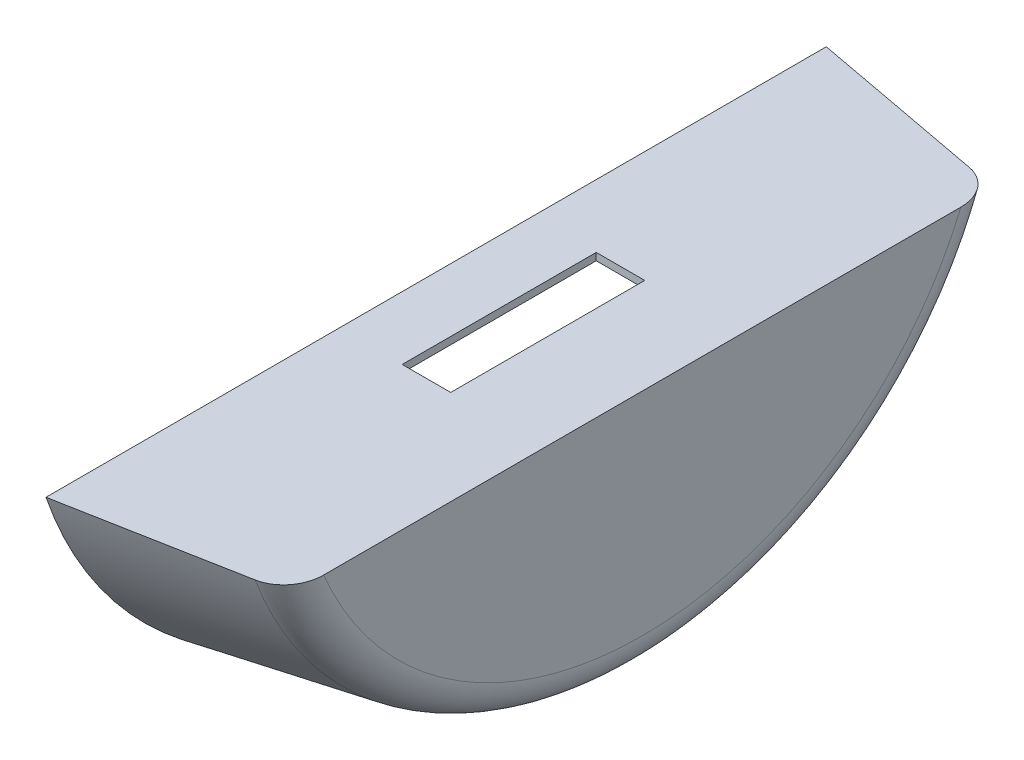
ISO-10303-21;
HEADER;
FILE_DESCRIPTION(('STEP AP214'),'2;1');
FILE_NAME('part.step','',(''),(''),'','','');
FILE_SCHEMA(('AUTOMOTIVE_DESIGN { 1 0 10303 214 1 1 1 1 }'));
ENDSEC;
DATA;
#1=APPLICATION_CONTEXT('core data for automotive mechanical design processes');
#2=APPLICATION_PROTOCOL_DEFINITION('international standard','automotive_design',2000,#1);
#3=PRODUCT_CONTEXT('',#1,'mechanical');
#4=PRODUCT('Part','Part','',(#3));
#5=PRODUCT_RELATED_PRODUCT_CATEGORY('part','',(#4));
#6=PRODUCT_DEFINITION_FORMATION('','',#4);
#7=PRODUCT_DEFINITION_CONTEXT('part definition',#1,'design');
#8=PRODUCT_DEFINITION('design','',#6,#7);
#9=PRODUCT_DEFINITION_SHAPE('','',#8);
#10=(LENGTH_UNIT() NAMED_UNIT(*) SI_UNIT(.MILLI.,.METRE.));
#11=(NAMED_UNIT(*) PLANE_ANGLE_UNIT() SI_UNIT($,.RADIAN.));
#12=(NAMED_UNIT(*) SI_UNIT($,.STERADIAN.) SOLID_ANGLE_UNIT());
#13=UNCERTAINTY_MEASURE_WITH_UNIT(LENGTH_MEASURE(1.E-05),#10,'distance_accuracy_value','');
#14=(GEOMETRIC_REPRESENTATION_CONTEXT(3) GLOBAL_UNCERTAINTY_ASSIGNED_CONTEXT((#13)) GLOBAL_UNIT_ASSIGNED_CONTEXT((#10,
#11,#12)) REPRESENTATION_CONTEXT('',''));
#15=CARTESIAN_POINT('',(0.,0.,0.));
#16=DIRECTION('',(0.,0.,1.));
#17=DIRECTION('',(1.,0.,0.));
#18=AXIS2_PLACEMENT_3D('',#15,#16,#17);
#19=CARTESIAN_POINT('',(85.,-55.,160.857079421454));
#20=DIRECTION('',(0.,-1.,0.));
#21=DIRECTION('',(0.,0.,-1.));
#22=AXIS2_PLACEMENT_3D('',#19,#20,#21);
#23=PLANE('',#22);
#24=DIRECTION('',(1.,0.,0.));
#25=VECTOR('',#24,1.);
#26=CARTESIAN_POINT('',(26.,-55.,40.));
#27=LINE('',#26,#25);
#28=CARTESIAN_POINT('',(26.,-55.,40.));
#29=VERTEX_POINT('',#28);
#30=CARTESIAN_POINT('',(46.,-55.,40.));
#31=VERTEX_POINT('',#30);
#32=EDGE_CURVE('E126',#29,#31,#27,.T.);
#33=ORIENTED_EDGE('',*,*,#32,.F.);
#34=DIRECTION('',(0.,0.,1.));
#35=VECTOR('',#34,1.);
#36=CARTESIAN_POINT('',(26.,-55.,-40.));
#37=LINE('',#36,#35);
#38=CARTESIAN_POINT('',(26.,-55.,-40.));
#39=VERTEX_POINT('',#38);
#40=EDGE_CURVE('E53',#39,#29,#37,.T.);
#41=ORIENTED_EDGE('',*,*,#40,.F.);
#42=DIRECTION('',(-1.,0.,0.));
#43=VECTOR('',#42,1.);
#44=CARTESIAN_POINT('',(26.,-55.,-40.));
#45=LINE('',#44,#43);
#46=CARTESIAN_POINT('',(46.,-55.,-40.));
#47=VERTEX_POINT('',#46);
#48=EDGE_CURVE('E132',#47,#39,#45,.T.);
#49=ORIENTED_EDGE('',*,*,#48,.F.);
#50=DIRECTION('',(0.,0.,-1.));
#51=VECTOR('',#50,1.);
#52=CARTESIAN_POINT('',(46.,-55.,-40.));
#53=LINE('',#52,#51);
#54=EDGE_CURVE('E117',#31,#47,#53,.T.);
#55=ORIENTED_EDGE('',*,*,#54,.F.);
#56=EDGE_LOOP('',(#33,#41,#49,#55));
#57=FACE_BOUND('',#56,.T.);
#58=DIRECTION('',(0.,0.,1.));
#59=VECTOR('',#58,1.);
#60=CARTESIAN_POINT('',(85.,-55.,160.857079421454));
#61=LINE('',#60,#59);
#62=CARTESIAN_POINT('',(85.,-55.,-131.366333308354));
#63=VERTEX_POINT('',#62);
#64=CARTESIAN_POINT('',(85.,-55.,131.366333308354));
#65=VERTEX_POINT('',#64);
#66=EDGE_CURVE('E198',#63,#65,#61,.T.);
#67=ORIENTED_EDGE('',*,*,#66,.F.);
#68=CARTESIAN_POINT('',(85.,-55.,-131.366333308354));
#69=CARTESIAN_POINT('',(85.0000217004886,-55.,-131.847998113283));
#70=CARTESIAN_POINT('',(84.9802595354916,-55.,-132.329657395687));
#71=CARTESIAN_POINT('',(84.9011367002977,-55.,-133.289800004888));
#72=CARTESIAN_POINT('',(84.8417685568107,-55.,-133.768282715082));
#73=CARTESIAN_POINT('',(84.6832129300085,-55.,-134.719863483213));
#74=CARTESIAN_POINT('',(84.583930224991,-55.,-135.19294586246));
#75=CARTESIAN_POINT('',(84.4053680370169,-55.,-135.894858542271));
#76=CARTESIAN_POINT('',(84.3409069757242,-55.,-136.127546144907));
#77=CARTESIAN_POINT('',(84.2021258271212,-55.,-136.590036884932));
#78=CARTESIAN_POINT('',(84.1278028946521,-55.,-136.81983916888));
#79=CARTESIAN_POINT('',(83.8899138443698,-55.,-137.50481973047));
#80=CARTESIAN_POINT('',(83.7115817841546,-55.,-137.954963685884));
#81=CARTESIAN_POINT('',(83.3163158102203,-55.,-138.837973459826));
#82=CARTESIAN_POINT('',(83.099384054965,-55.,-139.270840242824));
#83=CARTESIAN_POINT('',(82.7459672048439,-55.,-139.904131876115));
#84=CARTESIAN_POINT('',(82.6235365205562,-55.,-140.112495194183));
#85=CARTESIAN_POINT('',(82.3694952423523,-55.,-140.523470720562));
#86=CARTESIAN_POINT('',(82.237887022758,-55.,-140.726084397419));
#87=CARTESIAN_POINT('',(81.8294880486506,-55.,-141.324693126233));
#88=CARTESIAN_POINT('',(81.5390787653405,-55.,-141.711535235013));
#89=CARTESIAN_POINT('',(80.9387071454015,-55.,-142.438788278811));
#90=CARTESIAN_POINT('',(80.6303612108533,-55.,-142.780538325928));
#91=CARTESIAN_POINT('',(79.9843272088582,-55.,-143.435145956842));
#92=CARTESIAN_POINT('',(79.6466392545106,-55.,-143.748003651995));
#93=CARTESIAN_POINT('',(78.9443451986342,-55.,-144.341567587087));
#94=CARTESIAN_POINT('',(78.57975118395,-55.,-144.622288120944));
#95=CARTESIAN_POINT('',(77.8261656550564,-55.,-145.148788909642));
#96=CARTESIAN_POINT('',(77.437177114483,-55.,-145.39457341122));
#97=CARTESIAN_POINT('',(76.694161547378,-55.,-145.816535994463));
#98=CARTESIAN_POINT('',(76.3429239530571,-55.,-145.997642073186));
#99=CARTESIAN_POINT('',(75.6268790955325,-55.,-146.330540077362));
#100=CARTESIAN_POINT('',(75.2620740848824,-55.,-146.482336843261));
#101=CARTESIAN_POINT('',(74.5204893155726,-55.,-146.755560760924));
#102=CARTESIAN_POINT('',(74.1436899653607,-55.,-146.876935013921));
#103=CARTESIAN_POINT('',(73.5719149377617,-55.,-147.035132327188));
#104=CARTESIAN_POINT('',(73.3801725514498,-55.,-147.083897749144));
#105=CARTESIAN_POINT('',(72.9948111101114,-55.,-147.173364490282));
#106=CARTESIAN_POINT('',(72.801192012158,-55.,-147.214065624547));
#107=CARTESIAN_POINT('',(72.6067800086354,-55.,-147.250688194082));
#108=B_SPLINE_CURVE_WITH_KNOTS('',3,(#68,#69,#70,#71,#72,#73,#74,#75,#76,#77,#78,#79,#80,#81,
#82,#83,#84,#85,#86,#87,#88,#89,#90,#91,#92,#93,#94,#95,#96,#97,#98,#99,#100,#101,#102,#103,
#104,#105,#106,#107),.UNSPECIFIED.,.F.,.F.,(4,2,2,2,2,2,2,2,2,2,2,2,2,2,2,2,2,2,2,4),(0.,
1.44456767068413,2.88940799535424,4.33771583619181,5.0618815135296,5.78625656943377,
7.23688231549019,8.68742696921058,9.41222339522974,10.1368329997473,11.5857806690169,
12.9649117820621,14.3440375794608,15.7225475683278,17.1008898454341,18.2851531096823,
19.4692206247268,20.6553329363939,21.2487220953515,21.8421248593961),.UNSPECIFIED.);
#109=CARTESIAN_POINT('',(72.6067800086356,-55.,-147.250688194082));
#110=VERTEX_POINT('',#109);
#111=EDGE_CURVE('E238',#63,#110,#108,.T.);
#112=ORIENTED_EDGE('',*,*,#111,.T.);
#113=CARTESIAN_POINT('',(85.,-55.,-144.913767461894));
#114=CARTESIAN_POINT('',(77.9181877995605,-55.,-146.250475895791));
#115=CARTESIAN_POINT('',(70.8359537483595,-55.,-147.584948260698));
#116=CARTESIAN_POINT('',(56.6707071538972,-55.,-150.249743453704));
#117=CARTESIAN_POINT('',(49.5876946108658,-55.,-151.580066283027));
#118=CARTESIAN_POINT('',(35.4209523438063,-55.,-154.236885741812));
#119=CARTESIAN_POINT('',(28.3372226198058,-55.,-155.563382371422));
#120=CARTESIAN_POINT('',(14.1690970376694,-55.,-158.212825093285));
#121=CARTESIAN_POINT('',(7.08470117933804,-55.,-159.535771184491));
#122=CARTESIAN_POINT('',(-2.46823692712278E-12,-55.,-160.857079421454));
#123=B_SPLINE_CURVE_WITH_KNOTS('',3,(#113,#114,#115,#116,#117,#118,#119,#120,#121,#122),
.UNSPECIFIED.,.F.,.F.,(4,2,2,2,4),(0.,21.6205840064883,43.2411616446974,64.8617384480145,
86.4823216180021),.UNSPECIFIED.);
#124=CARTESIAN_POINT('',(0.,-55.,-160.857079421454));
#125=VERTEX_POINT('',#124);
#126=EDGE_CURVE('E213',#110,#125,#123,.T.);
#127=ORIENTED_EDGE('',*,*,#126,.T.);
#128=DIRECTION('',(0.,0.,1.));
#129=VECTOR('',#128,1.);
#130=CARTESIAN_POINT('',(0.,-55.,160.857079421454));
#131=LINE('',#130,#129);
#132=CARTESIAN_POINT('',(0.,-55.,160.857079421454));
#133=VERTEX_POINT('',#132);
#134=EDGE_CURVE('E202',#125,#133,#131,.T.);
#135=ORIENTED_EDGE('',*,*,#134,.T.);
#136=CARTESIAN_POINT('',(-2.46635043204502E-12,-55.,160.857079421454));
#137=CARTESIAN_POINT('',(7.08470117933805,-55.,159.535771184491));
#138=CARTESIAN_POINT('',(14.1690970376694,-55.,158.212825093285));
#139=CARTESIAN_POINT('',(28.3372226198058,-55.,155.563382371422));
#140=CARTESIAN_POINT('',(35.4209523438063,-55.,154.236885741812));
#141=CARTESIAN_POINT('',(49.5876946108658,-55.,151.580066283027));
#142=CARTESIAN_POINT('',(56.6707071538972,-55.,150.249743453704));
#143=CARTESIAN_POINT('',(70.8359537483595,-55.,147.584948260698));
#144=CARTESIAN_POINT('',(77.9181877995605,-55.,146.250475895791));
#145=CARTESIAN_POINT('',(85.,-55.,144.913767461894));
#146=B_SPLINE_CURVE_WITH_KNOTS('',3,(#136,#137,#138,#139,#140,#141,#142,#143,#144,#145),
.UNSPECIFIED.,.F.,.F.,(4,2,2,2,4),(0.,21.6205831699876,43.2411599733046,64.8617376115138,
86.4823216180021),.UNSPECIFIED.);
#147=CARTESIAN_POINT('',(72.6067800086356,-55.,147.250688194082));
#148=VERTEX_POINT('',#147);
#149=EDGE_CURVE('E201',#133,#148,#146,.T.);
#150=ORIENTED_EDGE('',*,*,#149,.T.);
#151=CARTESIAN_POINT('',(72.6067800086357,-55.,147.250688194082));
#152=CARTESIAN_POINT('',(72.8084757428878,-55.,147.212693540349));
#153=CARTESIAN_POINT('',(73.0093168639264,-55.,147.170309174983));
#154=CARTESIAN_POINT('',(73.4089620994576,-55.,147.07686566863));
#155=CARTESIAN_POINT('',(73.6077662996728,-55.,147.025806894304));
#156=CARTESIAN_POINT('',(74.2004683692027,-55.,146.859823465695));
#157=CARTESIAN_POINT('',(74.5908491990172,-55.,146.732055170783));
#158=CARTESIAN_POINT('',(75.3580921684318,-55.,146.443961781262));
#159=CARTESIAN_POINT('',(75.7349889515207,-55.,146.283728412328));
#160=CARTESIAN_POINT('',(76.4739065579847,-55.,145.931967838129));
#161=CARTESIAN_POINT('',(76.835926819123,-55.,145.740439451474));
#162=CARTESIAN_POINT('',(77.5424792595213,-55.,145.327959200858));
#163=CARTESIAN_POINT('',(77.8870220567728,-55.,145.107025504335));
#164=CARTESIAN_POINT('',(78.5567613472811,-55.,144.637551570852));
#165=CARTESIAN_POINT('',(78.8819570371296,-55.,144.389010188683));
#166=CARTESIAN_POINT('',(79.5112085445602,-55.,143.866314432439));
#167=CARTESIAN_POINT('',(79.8152582482175,-55.,143.592152704028));
#168=CARTESIAN_POINT('',(80.400498011386,-55.,143.020440853485));
#169=CARTESIAN_POINT('',(80.6816875690996,-55.,142.722890218229));
#170=CARTESIAN_POINT('',(81.2296546045716,-55.,142.095373914813));
#171=CARTESIAN_POINT('',(81.4955308893981,-55.,141.764621345446));
#172=CARTESIAN_POINT('',(81.9999596491653,-55.,141.082909064762));
#173=CARTESIAN_POINT('',(82.2385114074563,-55.,140.731948823813));
#174=CARTESIAN_POINT('',(82.6873829850911,-55.,140.012152130531));
#175=CARTESIAN_POINT('',(82.897686656453,-55.,139.643305616105));
#176=CARTESIAN_POINT('',(83.2890880218411,-55.,138.890448800624));
#177=CARTESIAN_POINT('',(83.4701855673533,-55.,138.506438422472));
#178=CARTESIAN_POINT('',(83.8138339665425,-55.,137.699258197001));
#179=CARTESIAN_POINT('',(83.974295954884,-55.,137.275198249569));
#180=CARTESIAN_POINT('',(84.2606968808077,-55.,136.415569443841));
#181=CARTESIAN_POINT('',(84.3866339097594,-55.,135.979999950725));
#182=CARTESIAN_POINT('',(84.6035288752233,-55.,135.100758646193));
#183=CARTESIAN_POINT('',(84.6945244356241,-55.,134.6570960916));
#184=CARTESIAN_POINT('',(84.8415337777451,-55.,133.764182663562));
#185=CARTESIAN_POINT('',(84.8975632163205,-55.,133.314934383292));
#186=CARTESIAN_POINT('',(84.95744247887,-55.,132.61501204423));
#187=CARTESIAN_POINT('',(84.9734211629862,-55.,132.365315766274));
#188=CARTESIAN_POINT('',(84.994691095831,-55.,131.865864921181));
#189=CARTESIAN_POINT('',(84.9999992546784,-55.,131.616111074578));
#190=CARTESIAN_POINT('',(85.,-55.,131.366333308354));
#191=B_SPLINE_CURVE_WITH_KNOTS('',3,(#151,#152,#153,#154,#155,#156,#157,#158,#159,#160,#161,
#162,#163,#164,#165,#166,#167,#168,#169,#170,#171,#172,#173,#174,#175,#176,#177,#178,#179,#180,
#181,#182,#183,#184,#185,#186,#187,#188,#189,#190),.UNSPECIFIED.,.F.,.F.,(4,2,2,2,2,2,2,2,2,2,2,
2,2,2,2,2,2,2,2,4),(0.,0.615627223772209,1.23122843190879,2.46184212259638,3.68902618718072,
4.9162565888527,6.14273226208839,7.36925883046706,8.59613856192767,9.82304521706971,
11.0947528278651,12.3664937845381,13.6389586640896,14.9114300139533,16.2701431291207,
17.6289313423855,18.9862523242694,20.3429650987261,21.093383596197,21.8426119271803),.UNSPECIFIED.);
#192=EDGE_CURVE('E233',#148,#65,#191,.T.);
#193=ORIENTED_EDGE('',*,*,#192,.T.);
#194=EDGE_LOOP('',(#67,#112,#127,#135,#150,#193));
#195=FACE_BOUND('',#194,.T.);
#196=ADVANCED_FACE('F37',(#57,#195),#23,.F.);
#197=CARTESIAN_POINT('',(85.,0.,0.));
#198=DIRECTION('',(1.,0.,0.));
#199=DIRECTION('',(0.,0.,-1.));
#200=AXIS2_PLACEMENT_3D('',#197,#198,#199);
#201=PLANE('',#200);
#202=ORIENTED_EDGE('',*,*,#66,.T.);
#203=CARTESIAN_POINT('',(85.,0.,0.));
#204=DIRECTION('',(1.,0.,0.));
#205=DIRECTION('',(0.,0.,-1.));
#206=AXIS2_PLACEMENT_3D('',#203,#204,#205);
#207=CIRCLE('',#206,142.415285439736);
#208=EDGE_CURVE('E239',#65,#63,#207,.T.);
#209=ORIENTED_EDGE('',*,*,#208,.T.);
#210=EDGE_LOOP('',(#202,#209));
#211=FACE_BOUND('',#210,.T.);
#212=ADVANCED_FACE('F225',(#211),#201,.T.);
#213=CARTESIAN_POINT('',(0.,0.,0.));
#214=DIRECTION('',(1.,0.,0.));
#215=DIRECTION('',(0.,0.,-1.));
#216=AXIS2_PLACEMENT_3D('',#213,#214,#215);
#217=PLANE('',#216);
#218=DIRECTION('',(0.,0.,1.));
#219=VECTOR('',#218,1.);
#220=CARTESIAN_POINT('',(0.,-58.,160.857079421454));
#221=LINE('',#220,#219);
#222=CARTESIAN_POINT('',(0.,-58.,-156.555164995341));
#223=VERTEX_POINT('',#222);
#224=CARTESIAN_POINT('',(0.,-58.,156.555164995341));
#225=VERTEX_POINT('',#224);
#226=EDGE_CURVE('E146',#223,#225,#221,.T.);
#227=ORIENTED_EDGE('',*,*,#226,.T.);
#228=CARTESIAN_POINT('',(0.,0.,0.));
#229=DIRECTION('',(1.,0.,0.));
#230=DIRECTION('',(0.,0.,-1.));
#231=AXIS2_PLACEMENT_3D('',#228,#229,#230);
#232=CIRCLE('',#231,166.953645323241);
#233=EDGE_CURVE('E139',#225,#223,#232,.T.);
#234=ORIENTED_EDGE('',*,*,#233,.T.);
#235=EDGE_LOOP('',(#227,#234));
#236=FACE_BOUND('',#235,.T.);
#237=CARTESIAN_POINT('',(0.,0.,0.));
#238=DIRECTION('',(1.,0.,0.));
#239=DIRECTION('',(0.,0.,-1.));
#240=AXIS2_PLACEMENT_3D('',#237,#238,#239);
#241=CIRCLE('',#240,170.);
#242=EDGE_CURVE('E193',#133,#125,#241,.T.);
#243=ORIENTED_EDGE('',*,*,#242,.F.);
#244=ORIENTED_EDGE('',*,*,#134,.F.);
#245=EDGE_LOOP('',(#243,#244));
#246=FACE_BOUND('',#245,.T.);
#247=ADVANCED_FACE('F226',(#236,#246),#217,.F.);
#248=CARTESIAN_POINT('',(85.,0.,0.));
#249=DIRECTION('',(-1.,0.,0.));
#250=DIRECTION('',(0.,0.,1.));
#251=AXIS2_PLACEMENT_3D('',#248,#249,#250);
#252=CONICAL_SURFACE('',#251,155.,0.174672199008235);
#253=ORIENTED_EDGE('',*,*,#126,.F.);
#254=CARTESIAN_POINT('',(72.6067800086356,0.,0.));
#255=DIRECTION('',(1.,0.,0.));
#256=DIRECTION('',(0.,0.,-1.));
#257=AXIS2_PLACEMENT_3D('',#254,#255,#256);
#258=CIRCLE('',#257,157.187038822005);
#259=EDGE_CURVE('E245',#110,#148,#258,.F.);
#260=ORIENTED_EDGE('',*,*,#259,.T.);
#261=ORIENTED_EDGE('',*,*,#149,.F.);
#262=ORIENTED_EDGE('',*,*,#242,.T.);
#263=EDGE_LOOP('',(#253,#260,#261,#262));
#264=FACE_BOUND('',#263,.T.);
#265=ADVANCED_FACE('F220',(#264),#252,.T.);
#266=CARTESIAN_POINT('',(70.,0.,0.));
#267=DIRECTION('',(1.,0.,0.));
#268=DIRECTION('',(0.,0.,-1.));
#269=AXIS2_PLACEMENT_3D('',#266,#267,#268);
#270=TOROIDAL_SURFACE('',#269,142.415285439736,15.);
#271=ORIENTED_EDGE('',*,*,#192,.F.);
#272=ORIENTED_EDGE('',*,*,#259,.F.);
#273=ORIENTED_EDGE('',*,*,#111,.F.);
#274=ORIENTED_EDGE('',*,*,#208,.F.);
#275=EDGE_LOOP('',(#271,#272,#273,#274));
#276=FACE_BOUND('',#275,.T.);
#277=ADVANCED_FACE('F39',(#276),#270,.T.);
#278=CARTESIAN_POINT('',(85.,-58.,160.857079421454));
#279=DIRECTION('',(0.,-1.,0.));
#280=DIRECTION('',(0.,0.,-1.));
#281=AXIS2_PLACEMENT_3D('',#278,#279,#280);
#282=PLANE('',#281);
#283=DIRECTION('',(0.,0.,-1.));
#284=VECTOR('',#283,1.);
#285=CARTESIAN_POINT('',(26.,-58.,160.857079421454));
#286=LINE('',#285,#284);
#287=CARTESIAN_POINT('',(26.,-58.,40.));
#288=VERTEX_POINT('',#287);
#289=CARTESIAN_POINT('',(26.,-58.,-40.));
#290=VERTEX_POINT('',#289);
#291=EDGE_CURVE('E11',#288,#290,#286,.T.);
#292=ORIENTED_EDGE('',*,*,#291,.F.);
#293=DIRECTION('',(-1.,0.,0.));
#294=VECTOR('',#293,1.);
#295=CARTESIAN_POINT('',(85.,-58.,40.));
#296=LINE('',#295,#294);
#297=CARTESIAN_POINT('',(46.,-58.,40.));
#298=VERTEX_POINT('',#297);
#299=EDGE_CURVE('E247',#298,#288,#296,.T.);
#300=ORIENTED_EDGE('',*,*,#299,.F.);
#301=DIRECTION('',(0.,0.,1.));
#302=VECTOR('',#301,1.);
#303=CARTESIAN_POINT('',(46.,-58.,160.857079421454));
#304=LINE('',#303,#302);
#305=CARTESIAN_POINT('',(46.,-58.,-40.));
#306=VERTEX_POINT('',#305);
#307=EDGE_CURVE('E120',#306,#298,#304,.T.);
#308=ORIENTED_EDGE('',*,*,#307,.F.);
#309=DIRECTION('',(1.,0.,0.));
#310=VECTOR('',#309,1.);
#311=CARTESIAN_POINT('',(85.,-58.,-40.));
#312=LINE('',#311,#310);
#313=EDGE_CURVE('E46',#290,#306,#312,.T.);
#314=ORIENTED_EDGE('',*,*,#313,.F.);
#315=EDGE_LOOP('',(#292,#300,#308,#314));
#316=FACE_BOUND('',#315,.T.);
#317=DIRECTION('',(0.,0.,1.));
#318=VECTOR('',#317,1.);
#319=CARTESIAN_POINT('',(82.,-58.,160.857079421454));
#320=LINE('',#319,#318);
#321=CARTESIAN_POINT('',(82.,-58.,-130.069648753587));
#322=VERTEX_POINT('',#321);
#323=CARTESIAN_POINT('',(82.,-58.,130.069648753587));
#324=VERTEX_POINT('',#323);
#325=EDGE_CURVE('E142',#322,#324,#320,.T.);
#326=ORIENTED_EDGE('',*,*,#325,.T.);
#327=CARTESIAN_POINT('',(72.0854240069084,-58.,142.91158837758));
#328=CARTESIAN_POINT('',(72.2461034110488,-58.,142.880987485106));
#329=CARTESIAN_POINT('',(72.4060903693426,-58.,142.846868533694));
#330=CARTESIAN_POINT('',(72.7244190142543,-58.,142.771683204182));
#331=CARTESIAN_POINT('',(72.8827607455175,-58.,142.73061701513));
#332=CARTESIAN_POINT('',(73.354774052952,-58.,142.5971749222));
#333=CARTESIAN_POINT('',(73.6656043222691,-58.,142.494522919624));
#334=CARTESIAN_POINT('',(74.2762828604684,-58.,142.263264006752));
#335=CARTESIAN_POINT('',(74.5761624227544,-58.,142.134739237736));
#336=CARTESIAN_POINT('',(75.163990002546,-58.,141.852775583933));
#337=CARTESIAN_POINT('',(75.4519374509505,-58.,141.699335512527));
#338=CARTESIAN_POINT('',(76.0137910991672,-58.,141.369125962237));
#339=CARTESIAN_POINT('',(76.2877087095988,-58.,141.192375873792));
#340=CARTESIAN_POINT('',(76.8201419784555,-58.,140.817014547885));
#341=CARTESIAN_POINT('',(77.0786566960043,-58.,140.618401977072));
#342=CARTESIAN_POINT('',(77.5789337548758,-58.,140.200925783584));
#343=CARTESIAN_POINT('',(77.8206896388155,-58.,139.982054429975));
#344=CARTESIAN_POINT('',(78.2861205151662,-58.,139.525874590414));
#345=CARTESIAN_POINT('',(78.5097950393669,-58.,139.288565627338));
#346=CARTESIAN_POINT('',(78.9471492696014,-58.,138.78683971257));
#347=CARTESIAN_POINT('',(79.1599985495505,-58.,138.521698920798));
#348=CARTESIAN_POINT('',(79.5640278584284,-58.,137.975280696217));
#349=CARTESIAN_POINT('',(79.7552008737889,-58.,137.693998084651));
#350=CARTESIAN_POINT('',(80.1151107538316,-58.,137.117291860821));
#351=CARTESIAN_POINT('',(80.2838391060503,-58.,136.821862940808));
#352=CARTESIAN_POINT('',(80.5981948392207,-58.,136.21895385221));
#353=CARTESIAN_POINT('',(80.743820637193,-58.,135.911472859621));
#354=CARTESIAN_POINT('',(81.0219646223929,-58.,135.262052864015));
#355=CARTESIAN_POINT('',(81.1525759212371,-58.,134.919296288148));
#356=CARTESIAN_POINT('',(81.3860195463758,-58.,134.224562166482));
#357=CARTESIAN_POINT('',(81.4888587050696,-58.,133.872586912045));
#358=CARTESIAN_POINT('',(81.66649709776,-58.,133.161961649622));
#359=CARTESIAN_POINT('',(81.7413197773652,-58.,132.803317487561));
#360=CARTESIAN_POINT('',(81.8629099819162,-58.,132.081439906355));
#361=CARTESIAN_POINT('',(81.9096896120822,-58.,131.718208536589));
#362=CARTESIAN_POINT('',(81.9616657344282,-58.,131.140143270744));
#363=CARTESIAN_POINT('',(81.9760591519448,-58.,130.926094497368));
#364=CARTESIAN_POINT('',(81.9952180889907,-58.,130.497919427653));
#365=CARTESIAN_POINT('',(81.9999994230594,-58.,130.283793839334));
#366=CARTESIAN_POINT('',(82.,-58.,130.069648753587));
#367=B_SPLINE_CURVE_WITH_KNOTS('',3,(#327,#328,#329,#330,#331,#332,#333,#334,#335,#336,#337,
#338,#339,#340,#341,#342,#343,#344,#345,#346,#347,#348,#349,#350,#351,#352,#353,#354,#355,#356,
#357,#358,#359,#360,#361,#362,#363,#364,#365,#366),.UNSPECIFIED.,.F.,.F.,(4,2,2,2,2,2,2,2,2,2,2,
2,2,2,2,2,2,2,2,4),(0.,0.490619524840906,0.981225701156537,1.96191885651386,2.93954624948224,
3.91722021676395,4.89408597615417,5.87101134574504,6.84831106805092,7.82563608908059,
8.8445524600791,9.8637975763241,10.8834281605573,11.9031285794027,13.0023231392977,
14.1012470325462,15.1992492243111,16.296777104346,16.9401787381079,17.5825209287974),.UNSPECIFIED.);
#368=CARTESIAN_POINT('',(72.0854240069084,-58.,142.91158837758));
#369=VERTEX_POINT('',#368);
#370=EDGE_CURVE('E156',#369,#324,#367,.T.);
#371=ORIENTED_EDGE('',*,*,#370,.F.);
#372=CARTESIAN_POINT('',(0.,-58.,156.555164995341));
#373=CARTESIAN_POINT('',(6.00829992239413,-58.,155.424448751444));
#374=CARTESIAN_POINT('',(12.0163323612745,-58.,154.292310601426));
#375=CARTESIAN_POINT('',(24.0318198493375,-58.,152.024984333529));
#376=CARTESIAN_POINT('',(30.0392748986904,-58.,150.889796216553));
#377=CARTESIAN_POINT('',(42.0535689433108,-58.,148.616163151883));
#378=CARTESIAN_POINT('',(48.0604079385575,-58.,147.47771820408));
#379=CARTESIAN_POINT('',(60.0734243637019,-58.,145.197333616956));
#380=CARTESIAN_POINT('',(66.0796017934032,-58.,144.055393976599));
#381=CARTESIAN_POINT('',(72.0854240069084,-58.,142.91158837758));
#382=B_SPLINE_CURVE_WITH_KNOTS('',3,(#372,#373,#374,#375,#376,#377,#378,#379,#380,#381),
.UNSPECIFIED.,.F.,.F.,(4,2,2,2,4),(0.,18.3413108571875,36.6826162851493,55.0239223273979,
73.3652337997801),.UNSPECIFIED.);
#383=EDGE_CURVE('E145',#225,#369,#382,.T.);
#384=ORIENTED_EDGE('',*,*,#383,.F.);
#385=ORIENTED_EDGE('',*,*,#226,.F.);
#386=CARTESIAN_POINT('',(72.0854240069084,-58.,-142.91158837758));
#387=CARTESIAN_POINT('',(66.0796017934031,-58.,-144.055393976599));
#388=CARTESIAN_POINT('',(60.0734243637019,-58.,-145.197333616956));
#389=CARTESIAN_POINT('',(48.0604079385575,-58.,-147.47771820408));
#390=CARTESIAN_POINT('',(42.0535689433108,-58.,-148.616163151883));
#391=CARTESIAN_POINT('',(30.0392748986904,-58.,-150.889796216553));
#392=CARTESIAN_POINT('',(24.0318198493375,-58.,-152.024984333529));
#393=CARTESIAN_POINT('',(12.0163323612745,-58.,-154.292310601426));
#394=CARTESIAN_POINT('',(6.00829992239414,-58.,-155.424448751444));
#395=CARTESIAN_POINT('',(0.,-58.,-156.555164995341));
#396=B_SPLINE_CURVE_WITH_KNOTS('',3,(#386,#387,#388,#389,#390,#391,#392,#393,#394,#395),
.UNSPECIFIED.,.F.,.F.,(4,2,2,2,4),(0.,18.3413114723822,36.6826175146308,55.0239229425926,
73.3652337997801),.UNSPECIFIED.);
#397=CARTESIAN_POINT('',(72.0854240069084,-58.,-142.91158837758));
#398=VERTEX_POINT('',#397);
#399=EDGE_CURVE('E157',#398,#223,#396,.T.);
#400=ORIENTED_EDGE('',*,*,#399,.F.);
#401=CARTESIAN_POINT('',(82.,-58.,-130.069648753587));
#402=CARTESIAN_POINT('',(82.0000190950265,-58.,-130.462372622982));
#403=CARTESIAN_POINT('',(81.983919013822,-58.,-130.855115827935));
#404=CARTESIAN_POINT('',(81.9194594347542,-58.,-131.638024096125));
#405=CARTESIAN_POINT('',(81.8710932989583,-58.,-132.028188612178));
#406=CARTESIAN_POINT('',(81.7419025161009,-58.,-132.804228121647));
#407=CARTESIAN_POINT('',(81.6609886661174,-58.,-133.190088306692));
#408=CARTESIAN_POINT('',(81.4668554446326,-58.,-133.953579378745));
#409=CARTESIAN_POINT('',(81.3536382841179,-58.,-134.33121082706));
#410=CARTESIAN_POINT('',(81.0949699767832,-58.,-135.07603181887));
#411=CARTESIAN_POINT('',(80.9494624585649,-58.,-135.443201818453));
#412=CARTESIAN_POINT('',(80.6268436867172,-58.,-136.163378861043));
#413=CARTESIAN_POINT('',(80.4497344439549,-58.,-136.516386803454));
#414=CARTESIAN_POINT('',(80.064863678515,-58.,-137.204801977604));
#415=CARTESIAN_POINT('',(79.8571353784129,-58.,-137.540227758359));
#416=CARTESIAN_POINT('',(79.4119290265177,-58.,-138.190721163671));
#417=CARTESIAN_POINT('',(79.1744532219109,-58.,-138.505790323285));
#418=CARTESIAN_POINT('',(78.6847642604907,-58.,-139.095960612591));
#419=CARTESIAN_POINT('',(78.4340459013414,-58.,-139.372302221498));
#420=CARTESIAN_POINT('',(77.908682647644,-58.,-139.901263670854));
#421=CARTESIAN_POINT('',(77.6340377328474,-58.,-140.153883491227));
#422=CARTESIAN_POINT('',(77.0628262909304,-58.,-140.63260007738));
#423=CARTESIAN_POINT('',(76.7662745002363,-58.,-140.858714412867));
#424=CARTESIAN_POINT('',(76.1532579662255,-58.,-141.282083886336));
#425=CARTESIAN_POINT('',(75.8367964868195,-58.,-141.479343737062));
#426=CARTESIAN_POINT('',(75.2453841367457,-58.,-141.809790324793));
#427=CARTESIAN_POINT('',(74.9732885683043,-58.,-141.94811175212));
#428=CARTESIAN_POINT('',(74.4190136221125,-58.,-142.202707123669));
#429=CARTESIAN_POINT('',(74.1368363082921,-58.,-142.318985550136));
#430=CARTESIAN_POINT('',(73.5635580661178,-58.,-142.528684593446));
#431=CARTESIAN_POINT('',(73.2724426662213,-58.,-142.62206567448));
#432=CARTESIAN_POINT('',(72.6834875809519,-58.,-142.784953078529));
#433=CARTESIAN_POINT('',(72.385645290087,-58.,-142.854449975542));
#434=CARTESIAN_POINT('',(72.0854240069084,-58.,-142.91158837758));
#435=B_SPLINE_CURVE_WITH_KNOTS('',3,(#401,#402,#403,#404,#405,#406,#407,#408,#409,#410,#411,
#412,#413,#414,#415,#416,#417,#418,#419,#420,#421,#422,#423,#424,#425,#426,#427,#428,#429,#430,
#431,#432,#433,#434),.UNSPECIFIED.,.F.,.F.,(4,2,2,2,2,2,2,2,2,2,2,2,2,2,2,2,4),(0.,
1.17787195569278,2.35598630379792,3.5373517301997,4.71863631792644,5.90199960600744,
7.08528762167256,8.26730105938425,9.44922525921001,10.5671354640005,11.6850466148628,
12.8022124939436,13.9191957043761,14.8339877084518,15.7485934979134,16.6647675478289,
17.5813027558441),.UNSPECIFIED.);
#436=EDGE_CURVE('E147',#322,#398,#435,.T.);
#437=ORIENTED_EDGE('',*,*,#436,.F.);
#438=EDGE_LOOP('',(#326,#371,#384,#385,#400,#437));
#439=FACE_BOUND('',#438,.T.);
#440=ADVANCED_FACE('F167',(#316,#439),#282,.T.);
#441=CARTESIAN_POINT('',(82.,0.,0.));
#442=DIRECTION('',(1.,0.,0.));
#443=DIRECTION('',(0.,0.,-1.));
#444=AXIS2_PLACEMENT_3D('',#441,#442,#443);
#445=PLANE('',#444);
#446=ORIENTED_EDGE('',*,*,#325,.F.);
#447=CARTESIAN_POINT('',(82.,0.,0.));
#448=DIRECTION('',(1.,0.,0.));
#449=DIRECTION('',(0.,0.,-1.));
#450=AXIS2_PLACEMENT_3D('',#447,#448,#449);
#451=CIRCLE('',#450,142.415285439736);
#452=EDGE_CURVE('E189',#324,#322,#451,.T.);
#453=ORIENTED_EDGE('',*,*,#452,.F.);
#454=EDGE_LOOP('',(#446,#453));
#455=FACE_BOUND('',#454,.T.);
#456=ADVANCED_FACE('F170',(#455),#445,.F.);
#457=CARTESIAN_POINT('',(84.4786439982729,0.,0.));
#458=DIRECTION('',(-1.,0.,0.));
#459=DIRECTION('',(0.,0.,1.));
#460=AXIS2_PLACEMENT_3D('',#457,#458,#459);
#461=CONICAL_SURFACE('',#460,152.045649323546,0.174672199008235);
#462=ORIENTED_EDGE('',*,*,#399,.T.);
#463=ORIENTED_EDGE('',*,*,#233,.F.);
#464=ORIENTED_EDGE('',*,*,#383,.T.);
#465=CARTESIAN_POINT('',(72.0854240069084,0.,0.));
#466=DIRECTION('',(-1.,0.,0.));
#467=DIRECTION('',(0.,0.,1.));
#468=AXIS2_PLACEMENT_3D('',#465,#466,#467);
#469=CIRCLE('',#468,154.232688145552);
#470=EDGE_CURVE('E155',#398,#369,#469,.T.);
#471=ORIENTED_EDGE('',*,*,#470,.F.);
#472=EDGE_LOOP('',(#462,#463,#464,#471));
#473=FACE_BOUND('',#472,.T.);
#474=ADVANCED_FACE('F172',(#473),#461,.F.);
#475=CARTESIAN_POINT('',(70.,0.,0.));
#476=DIRECTION('',(1.,0.,0.));
#477=DIRECTION('',(0.,0.,-1.));
#478=AXIS2_PLACEMENT_3D('',#475,#476,#477);
#479=TOROIDAL_SURFACE('',#478,142.415285439736,12.);
#480=ORIENTED_EDGE('',*,*,#370,.T.);
#481=ORIENTED_EDGE('',*,*,#452,.T.);
#482=ORIENTED_EDGE('',*,*,#436,.T.);
#483=ORIENTED_EDGE('',*,*,#470,.T.);
#484=EDGE_LOOP('',(#480,#481,#482,#483));
#485=FACE_BOUND('',#484,.T.);
#486=ADVANCED_FACE('F164',(#485),#479,.F.);
#487=CARTESIAN_POINT('',(26.,-65.,-40.));
#488=DIRECTION('',(-1.,0.,0.));
#489=DIRECTION('',(0.,0.,1.));
#490=AXIS2_PLACEMENT_3D('',#487,#488,#489);
#491=PLANE('',#490);
#492=ORIENTED_EDGE('',*,*,#291,.T.);
#493=DIRECTION('',(0.,1.,0.));
#494=VECTOR('',#493,1.);
#495=CARTESIAN_POINT('',(26.,-65.,-40.));
#496=LINE('',#495,#494);
#497=EDGE_CURVE('E137',#290,#39,#496,.T.);
#498=ORIENTED_EDGE('',*,*,#497,.T.);
#499=ORIENTED_EDGE('',*,*,#40,.T.);
#500=DIRECTION('',(0.,1.,0.));
#501=VECTOR('',#500,1.);
#502=CARTESIAN_POINT('',(26.,-65.,40.));
#503=LINE('',#502,#501);
#504=EDGE_CURVE('E123',#288,#29,#503,.T.);
#505=ORIENTED_EDGE('',*,*,#504,.F.);
#506=EDGE_LOOP('',(#492,#498,#499,#505));
#507=FACE_BOUND('',#506,.T.);
#508=ADVANCED_FACE('F255',(#507),#491,.F.);
#509=CARTESIAN_POINT('',(26.,-65.,-40.));
#510=DIRECTION('',(0.,0.,-1.));
#511=DIRECTION('',(-1.,0.,0.));
#512=AXIS2_PLACEMENT_3D('',#509,#510,#511);
#513=PLANE('',#512);
#514=ORIENTED_EDGE('',*,*,#313,.T.);
#515=DIRECTION('',(0.,1.,0.));
#516=VECTOR('',#515,1.);
#517=CARTESIAN_POINT('',(46.,-65.,-40.));
#518=LINE('',#517,#516);
#519=EDGE_CURVE('E122',#306,#47,#518,.T.);
#520=ORIENTED_EDGE('',*,*,#519,.T.);
#521=ORIENTED_EDGE('',*,*,#48,.T.);
#522=ORIENTED_EDGE('',*,*,#497,.F.);
#523=EDGE_LOOP('',(#514,#520,#521,#522));
#524=FACE_BOUND('',#523,.T.);
#525=ADVANCED_FACE('F252',(#524),#513,.F.);
#526=CARTESIAN_POINT('',(46.,-65.,-40.));
#527=DIRECTION('',(1.,0.,0.));
#528=DIRECTION('',(0.,0.,-1.));
#529=AXIS2_PLACEMENT_3D('',#526,#527,#528);
#530=PLANE('',#529);
#531=ORIENTED_EDGE('',*,*,#307,.T.);
#532=DIRECTION('',(0.,1.,0.));
#533=VECTOR('',#532,1.);
#534=CARTESIAN_POINT('',(46.,-65.,40.));
#535=LINE('',#534,#533);
#536=EDGE_CURVE('E61',#298,#31,#535,.T.);
#537=ORIENTED_EDGE('',*,*,#536,.T.);
#538=ORIENTED_EDGE('',*,*,#54,.T.);
#539=ORIENTED_EDGE('',*,*,#519,.F.);
#540=EDGE_LOOP('',(#531,#537,#538,#539));
#541=FACE_BOUND('',#540,.T.);
#542=ADVANCED_FACE('F114',(#541),#530,.F.);
#543=CARTESIAN_POINT('',(26.,-65.,40.));
#544=DIRECTION('',(0.,0.,1.));
#545=DIRECTION('',(1.,0.,0.));
#546=AXIS2_PLACEMENT_3D('',#543,#544,#545);
#547=PLANE('',#546);
#548=ORIENTED_EDGE('',*,*,#299,.T.);
#549=ORIENTED_EDGE('',*,*,#504,.T.);
#550=ORIENTED_EDGE('',*,*,#32,.T.);
#551=ORIENTED_EDGE('',*,*,#536,.F.);
#552=EDGE_LOOP('',(#548,#549,#550,#551));
#553=FACE_BOUND('',#552,.T.);
#554=ADVANCED_FACE('F127',(#553),#547,.F.);
#555=CLOSED_SHELL('',(#196,#212,#247,#265,#277,#440,#456,#474,#486,#508,#525,#542,#554));
#556=MANIFOLD_SOLID_BREP('B2',#555);
#557=ADVANCED_BREP_SHAPE_REPRESENTATION('',(#18,#556),#14);
#558=SHAPE_DEFINITION_REPRESENTATION(#9,#557);
ENDSEC;
END-ISO-10303-21;
